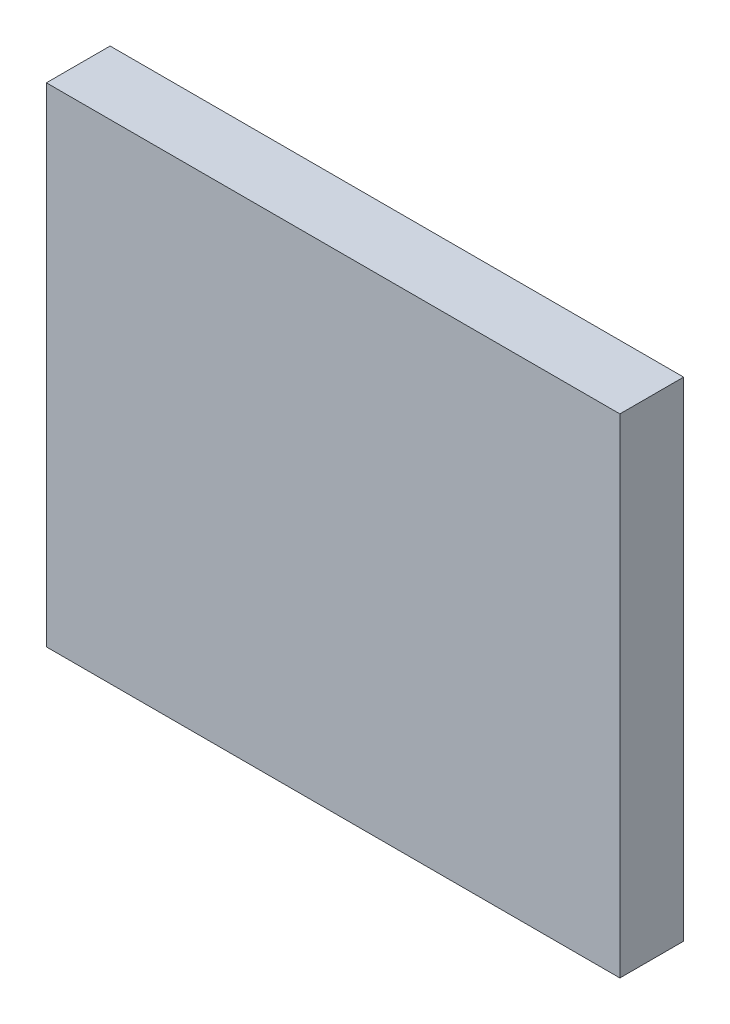
ISO-10303-21;
HEADER;
FILE_DESCRIPTION(('STEP AP214'),'2;1');
FILE_NAME('part.step','',(''),(''),'','','');
FILE_SCHEMA(('AUTOMOTIVE_DESIGN { 1 0 10303 214 1 1 1 1 }'));
ENDSEC;
DATA;
#1=APPLICATION_CONTEXT('core data for automotive mechanical design processes');
#2=APPLICATION_PROTOCOL_DEFINITION('international standard','automotive_design',2000,#1);
#3=PRODUCT_CONTEXT('',#1,'mechanical');
#4=PRODUCT('Part','Part','',(#3));
#5=PRODUCT_RELATED_PRODUCT_CATEGORY('part','',(#4));
#6=PRODUCT_DEFINITION_FORMATION('','',#4);
#7=PRODUCT_DEFINITION_CONTEXT('part definition',#1,'design');
#8=PRODUCT_DEFINITION('design','',#6,#7);
#9=PRODUCT_DEFINITION_SHAPE('','',#8);
#10=(LENGTH_UNIT() NAMED_UNIT(*) SI_UNIT(.MILLI.,.METRE.));
#11=(NAMED_UNIT(*) PLANE_ANGLE_UNIT() SI_UNIT($,.RADIAN.));
#12=(NAMED_UNIT(*) SI_UNIT($,.STERADIAN.) SOLID_ANGLE_UNIT());
#13=UNCERTAINTY_MEASURE_WITH_UNIT(LENGTH_MEASURE(1.E-05),#10,'distance_accuracy_value','');
#14=(GEOMETRIC_REPRESENTATION_CONTEXT(3) GLOBAL_UNCERTAINTY_ASSIGNED_CONTEXT((#13)) GLOBAL_UNIT_ASSIGNED_CONTEXT((#10,
#11,#12)) REPRESENTATION_CONTEXT('',''));
#15=CARTESIAN_POINT('',(0.,0.,0.));
#16=DIRECTION('',(0.,0.,1.));
#17=DIRECTION('',(1.,0.,0.));
#18=AXIS2_PLACEMENT_3D('',#15,#16,#17);
#19=CARTESIAN_POINT('',(13.5,-11.5,3.));
#20=DIRECTION('',(-1.,0.,0.));
#21=DIRECTION('',(0.,0.,1.));
#22=AXIS2_PLACEMENT_3D('',#19,#20,#21);
#23=PLANE('',#22);
#24=DIRECTION('',(0.,1.,0.));
#25=VECTOR('',#24,1.);
#26=CARTESIAN_POINT('',(13.5,-11.5,0.));
#27=LINE('',#26,#25);
#28=CARTESIAN_POINT('',(13.5,-11.5,0.));
#29=VERTEX_POINT('',#28);
#30=CARTESIAN_POINT('',(13.5,11.5,0.));
#31=VERTEX_POINT('',#30);
#32=EDGE_CURVE('E96',#29,#31,#27,.T.);
#33=ORIENTED_EDGE('',*,*,#32,.T.);
#34=DIRECTION('',(0.,0.,-1.));
#35=VECTOR('',#34,1.);
#36=CARTESIAN_POINT('',(13.5,11.5,3.));
#37=LINE('',#36,#35);
#38=CARTESIAN_POINT('',(13.5,11.5,3.));
#39=VERTEX_POINT('',#38);
#40=EDGE_CURVE('E11',#39,#31,#37,.T.);
#41=ORIENTED_EDGE('',*,*,#40,.F.);
#42=DIRECTION('',(0.,1.,0.));
#43=VECTOR('',#42,1.);
#44=CARTESIAN_POINT('',(13.5,-11.5,3.));
#45=LINE('',#44,#43);
#46=CARTESIAN_POINT('',(13.5,-11.5,3.));
#47=VERTEX_POINT('',#46);
#48=EDGE_CURVE('E84',#47,#39,#45,.T.);
#49=ORIENTED_EDGE('',*,*,#48,.F.);
#50=DIRECTION('',(0.,0.,-1.));
#51=VECTOR('',#50,1.);
#52=CARTESIAN_POINT('',(13.5,-11.5,3.));
#53=LINE('',#52,#51);
#54=EDGE_CURVE('E92',#47,#29,#53,.T.);
#55=ORIENTED_EDGE('',*,*,#54,.T.);
#56=EDGE_LOOP('',(#33,#41,#49,#55));
#57=FACE_BOUND('',#56,.T.);
#58=ADVANCED_FACE('F33',(#57),#23,.F.);
#59=CARTESIAN_POINT('',(-13.5,11.5,3.));
#60=DIRECTION('',(0.,-1.,0.));
#61=DIRECTION('',(0.,0.,-1.));
#62=AXIS2_PLACEMENT_3D('',#59,#60,#61);
#63=PLANE('',#62);
#64=DIRECTION('',(-1.,0.,0.));
#65=VECTOR('',#64,1.);
#66=CARTESIAN_POINT('',(-13.5,11.5,0.));
#67=LINE('',#66,#65);
#68=CARTESIAN_POINT('',(-13.5,11.5,0.));
#69=VERTEX_POINT('',#68);
#70=EDGE_CURVE('E88',#31,#69,#67,.T.);
#71=ORIENTED_EDGE('',*,*,#70,.T.);
#72=DIRECTION('',(0.,0.,-1.));
#73=VECTOR('',#72,1.);
#74=CARTESIAN_POINT('',(-13.5,11.5,3.));
#75=LINE('',#74,#73);
#76=CARTESIAN_POINT('',(-13.5,11.5,3.));
#77=VERTEX_POINT('',#76);
#78=EDGE_CURVE('E41',#77,#69,#75,.T.);
#79=ORIENTED_EDGE('',*,*,#78,.F.);
#80=DIRECTION('',(-1.,0.,0.));
#81=VECTOR('',#80,1.);
#82=CARTESIAN_POINT('',(-13.5,11.5,3.));
#83=LINE('',#82,#81);
#84=EDGE_CURVE('E79',#39,#77,#83,.T.);
#85=ORIENTED_EDGE('',*,*,#84,.F.);
#86=ORIENTED_EDGE('',*,*,#40,.T.);
#87=EDGE_LOOP('',(#71,#79,#85,#86));
#88=FACE_BOUND('',#87,.T.);
#89=ADVANCED_FACE('F87',(#88),#63,.F.);
#90=CARTESIAN_POINT('',(-13.5,-11.5,3.));
#91=DIRECTION('',(1.,0.,0.));
#92=DIRECTION('',(0.,0.,-1.));
#93=AXIS2_PLACEMENT_3D('',#90,#91,#92);
#94=PLANE('',#93);
#95=DIRECTION('',(0.,-1.,0.));
#96=VECTOR('',#95,1.);
#97=CARTESIAN_POINT('',(-13.5,-11.5,0.));
#98=LINE('',#97,#96);
#99=CARTESIAN_POINT('',(-13.5,-11.5,0.));
#100=VERTEX_POINT('',#99);
#101=EDGE_CURVE('E66',#69,#100,#98,.T.);
#102=ORIENTED_EDGE('',*,*,#101,.T.);
#103=DIRECTION('',(0.,0.,-1.));
#104=VECTOR('',#103,1.);
#105=CARTESIAN_POINT('',(-13.5,-11.5,3.));
#106=LINE('',#105,#104);
#107=CARTESIAN_POINT('',(-13.5,-11.5,3.));
#108=VERTEX_POINT('',#107);
#109=EDGE_CURVE('E89',#108,#100,#106,.T.);
#110=ORIENTED_EDGE('',*,*,#109,.F.);
#111=DIRECTION('',(0.,-1.,0.));
#112=VECTOR('',#111,1.);
#113=CARTESIAN_POINT('',(-13.5,-11.5,3.));
#114=LINE('',#113,#112);
#115=EDGE_CURVE('E82',#77,#108,#114,.T.);
#116=ORIENTED_EDGE('',*,*,#115,.F.);
#117=ORIENTED_EDGE('',*,*,#78,.T.);
#118=EDGE_LOOP('',(#102,#110,#116,#117));
#119=FACE_BOUND('',#118,.T.);
#120=ADVANCED_FACE('F90',(#119),#94,.F.);
#121=CARTESIAN_POINT('',(-13.5,-11.5,3.));
#122=DIRECTION('',(0.,1.,0.));
#123=DIRECTION('',(0.,0.,1.));
#124=AXIS2_PLACEMENT_3D('',#121,#122,#123);
#125=PLANE('',#124);
#126=DIRECTION('',(1.,0.,0.));
#127=VECTOR('',#126,1.);
#128=CARTESIAN_POINT('',(-13.5,-11.5,0.));
#129=LINE('',#128,#127);
#130=EDGE_CURVE('E72',#100,#29,#129,.T.);
#131=ORIENTED_EDGE('',*,*,#130,.T.);
#132=ORIENTED_EDGE('',*,*,#54,.F.);
#133=DIRECTION('',(1.,0.,0.));
#134=VECTOR('',#133,1.);
#135=CARTESIAN_POINT('',(-13.5,-11.5,3.));
#136=LINE('',#135,#134);
#137=EDGE_CURVE('E49',#108,#47,#136,.T.);
#138=ORIENTED_EDGE('',*,*,#137,.F.);
#139=ORIENTED_EDGE('',*,*,#109,.T.);
#140=EDGE_LOOP('',(#131,#132,#138,#139));
#141=FACE_BOUND('',#140,.T.);
#142=ADVANCED_FACE('F103',(#141),#125,.F.);
#143=CARTESIAN_POINT('',(0.,0.,3.));
#144=DIRECTION('',(0.,0.,-1.));
#145=DIRECTION('',(-1.,0.,0.));
#146=AXIS2_PLACEMENT_3D('',#143,#144,#145);
#147=PLANE('',#146);
#148=ORIENTED_EDGE('',*,*,#48,.T.);
#149=ORIENTED_EDGE('',*,*,#84,.T.);
#150=ORIENTED_EDGE('',*,*,#115,.T.);
#151=ORIENTED_EDGE('',*,*,#137,.T.);
#152=EDGE_LOOP('',(#148,#149,#150,#151));
#153=FACE_BOUND('',#152,.T.);
#154=ADVANCED_FACE('F80',(#153),#147,.F.);
#155=CARTESIAN_POINT('',(0.,0.,0.));
#156=DIRECTION('',(0.,0.,-1.));
#157=DIRECTION('',(-1.,0.,0.));
#158=AXIS2_PLACEMENT_3D('',#155,#156,#157);
#159=PLANE('',#158);
#160=ORIENTED_EDGE('',*,*,#32,.F.);
#161=ORIENTED_EDGE('',*,*,#130,.F.);
#162=ORIENTED_EDGE('',*,*,#101,.F.);
#163=ORIENTED_EDGE('',*,*,#70,.F.);
#164=EDGE_LOOP('',(#160,#161,#162,#163));
#165=FACE_BOUND('',#164,.T.);
#166=ADVANCED_FACE('F106',(#165),#159,.T.);
#167=CLOSED_SHELL('',(#58,#89,#120,#142,#154,#166));
#168=MANIFOLD_SOLID_BREP('B2',#167);
#169=ADVANCED_BREP_SHAPE_REPRESENTATION('',(#18,#168),#14);
#170=SHAPE_DEFINITION_REPRESENTATION(#9,#169);
ENDSEC;
END-ISO-10303-21;
